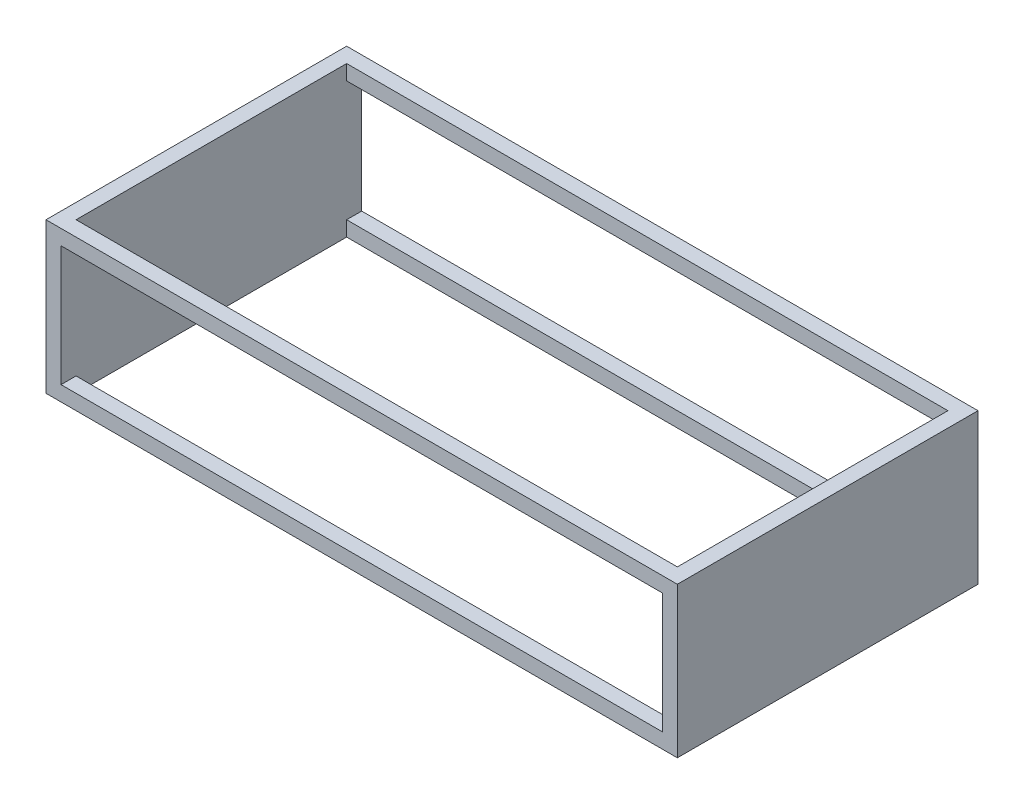
ISO-10303-21;
HEADER;
FILE_DESCRIPTION(('STEP AP214'),'2;1');
FILE_NAME('part.step','',(''),(''),'','','');
FILE_SCHEMA(('AUTOMOTIVE_DESIGN { 1 0 10303 214 1 1 1 1 }'));
ENDSEC;
DATA;
#1=APPLICATION_CONTEXT('core data for automotive mechanical design processes');
#2=APPLICATION_PROTOCOL_DEFINITION('international standard','automotive_design',2000,#1);
#3=PRODUCT_CONTEXT('',#1,'mechanical');
#4=PRODUCT('Part','Part','',(#3));
#5=PRODUCT_RELATED_PRODUCT_CATEGORY('part','',(#4));
#6=PRODUCT_DEFINITION_FORMATION('','',#4);
#7=PRODUCT_DEFINITION_CONTEXT('part definition',#1,'design');
#8=PRODUCT_DEFINITION('design','',#6,#7);
#9=PRODUCT_DEFINITION_SHAPE('','',#8);
#10=(LENGTH_UNIT() NAMED_UNIT(*) SI_UNIT(.MILLI.,.METRE.));
#11=(NAMED_UNIT(*) PLANE_ANGLE_UNIT() SI_UNIT($,.RADIAN.));
#12=(NAMED_UNIT(*) SI_UNIT($,.STERADIAN.) SOLID_ANGLE_UNIT());
#13=UNCERTAINTY_MEASURE_WITH_UNIT(LENGTH_MEASURE(1.E-05),#10,'distance_accuracy_value','');
#14=(GEOMETRIC_REPRESENTATION_CONTEXT(3) GLOBAL_UNCERTAINTY_ASSIGNED_CONTEXT((#13)) GLOBAL_UNIT_ASSIGNED_CONTEXT((#10,
#11,#12)) REPRESENTATION_CONTEXT('',''));
#15=CARTESIAN_POINT('',(0.,0.,0.));
#16=DIRECTION('',(0.,0.,1.));
#17=DIRECTION('',(1.,0.,0.));
#18=AXIS2_PLACEMENT_3D('',#15,#16,#17);
#19=CARTESIAN_POINT('',(-1000.,-250.001,450.));
#20=DIRECTION('',(0.,0.,1.));
#21=DIRECTION('',(1.,0.,0.));
#22=AXIS2_PLACEMENT_3D('',#19,#20,#21);
#23=PLANE('',#22);
#24=DIRECTION('',(0.,1.,0.));
#25=VECTOR('',#24,1.);
#26=CARTESIAN_POINT('',(-1000.,-250.001,450.));
#27=LINE('',#26,#25);
#28=CARTESIAN_POINT('',(-1000.,-250.,450.));
#29=VERTEX_POINT('',#28);
#30=CARTESIAN_POINT('',(-1000.,-200.,450.));
#31=VERTEX_POINT('',#30);
#32=EDGE_CURVE('E226',#29,#31,#27,.T.);
#33=ORIENTED_EDGE('',*,*,#32,.T.);
#34=DIRECTION('',(1.,0.,0.));
#35=VECTOR('',#34,1.);
#36=CARTESIAN_POINT('',(-1000.,-200.,450.));
#37=LINE('',#36,#35);
#38=CARTESIAN_POINT('',(1000.,-200.,450.));
#39=VERTEX_POINT('',#38);
#40=EDGE_CURVE('E192',#31,#39,#37,.T.);
#41=ORIENTED_EDGE('',*,*,#40,.T.);
#42=DIRECTION('',(0.,1.,0.));
#43=VECTOR('',#42,1.);
#44=CARTESIAN_POINT('',(1000.,-250.001,450.));
#45=LINE('',#44,#43);
#46=CARTESIAN_POINT('',(1000.,-250.,450.));
#47=VERTEX_POINT('',#46);
#48=EDGE_CURVE('E221',#47,#39,#45,.T.);
#49=ORIENTED_EDGE('',*,*,#48,.F.);
#50=DIRECTION('',(1.,0.,0.));
#51=VECTOR('',#50,1.);
#52=CARTESIAN_POINT('',(-1000.,-250.,450.));
#53=LINE('',#52,#51);
#54=EDGE_CURVE('E204',#29,#47,#53,.T.);
#55=ORIENTED_EDGE('',*,*,#54,.F.);
#56=EDGE_LOOP('',(#33,#41,#49,#55));
#57=FACE_BOUND('',#56,.T.);
#58=ADVANCED_FACE('F35',(#57),#23,.F.);
#59=CARTESIAN_POINT('',(-1000.,-250.001,-450.));
#60=DIRECTION('',(0.,0.,-1.));
#61=DIRECTION('',(-1.,0.,0.));
#62=AXIS2_PLACEMENT_3D('',#59,#60,#61);
#63=PLANE('',#62);
#64=DIRECTION('',(0.,1.,0.));
#65=VECTOR('',#64,1.);
#66=CARTESIAN_POINT('',(1000.,-250.001,-450.));
#67=LINE('',#66,#65);
#68=CARTESIAN_POINT('',(1000.,-250.,-450.));
#69=VERTEX_POINT('',#68);
#70=CARTESIAN_POINT('',(1000.,-200.,-450.));
#71=VERTEX_POINT('',#70);
#72=EDGE_CURVE('E234',#69,#71,#67,.T.);
#73=ORIENTED_EDGE('',*,*,#72,.T.);
#74=DIRECTION('',(-1.,0.,0.));
#75=VECTOR('',#74,1.);
#76=CARTESIAN_POINT('',(-1000.,-200.,-450.));
#77=LINE('',#76,#75);
#78=CARTESIAN_POINT('',(-1000.,-200.,-450.));
#79=VERTEX_POINT('',#78);
#80=EDGE_CURVE('E11',#71,#79,#77,.T.);
#81=ORIENTED_EDGE('',*,*,#80,.T.);
#82=DIRECTION('',(0.,1.,0.));
#83=VECTOR('',#82,1.);
#84=CARTESIAN_POINT('',(-1000.,-250.001,-450.));
#85=LINE('',#84,#83);
#86=CARTESIAN_POINT('',(-1000.,-250.,-450.));
#87=VERTEX_POINT('',#86);
#88=EDGE_CURVE('E230',#87,#79,#85,.T.);
#89=ORIENTED_EDGE('',*,*,#88,.F.);
#90=DIRECTION('',(-1.,0.,0.));
#91=VECTOR('',#90,1.);
#92=CARTESIAN_POINT('',(-1000.,-250.,-450.));
#93=LINE('',#92,#91);
#94=EDGE_CURVE('E224',#69,#87,#93,.T.);
#95=ORIENTED_EDGE('',*,*,#94,.F.);
#96=EDGE_LOOP('',(#73,#81,#89,#95));
#97=FACE_BOUND('',#96,.T.);
#98=ADVANCED_FACE('F301',(#97),#63,.F.);
#99=CARTESIAN_POINT('',(1050.,250.,500.));
#100=DIRECTION('',(-1.,0.,0.));
#101=DIRECTION('',(0.,0.,1.));
#102=AXIS2_PLACEMENT_3D('',#99,#100,#101);
#103=PLANE('',#102);
#104=DIRECTION('',(0.,0.,-1.));
#105=VECTOR('',#104,1.);
#106=CARTESIAN_POINT('',(1050.,-250.,500.));
#107=LINE('',#106,#105);
#108=CARTESIAN_POINT('',(1050.,-250.,500.));
#109=VERTEX_POINT('',#108);
#110=CARTESIAN_POINT('',(1050.,-250.,-500.));
#111=VERTEX_POINT('',#110);
#112=EDGE_CURVE('E239',#109,#111,#107,.T.);
#113=ORIENTED_EDGE('',*,*,#112,.T.);
#114=DIRECTION('',(0.,-1.,0.));
#115=VECTOR('',#114,1.);
#116=CARTESIAN_POINT('',(1050.,250.,-500.));
#117=LINE('',#116,#115);
#118=CARTESIAN_POINT('',(1050.,250.,-500.));
#119=VERTEX_POINT('',#118);
#120=EDGE_CURVE('E266',#119,#111,#117,.T.);
#121=ORIENTED_EDGE('',*,*,#120,.F.);
#122=DIRECTION('',(0.,0.,-1.));
#123=VECTOR('',#122,1.);
#124=CARTESIAN_POINT('',(1050.,250.,500.));
#125=LINE('',#124,#123);
#126=CARTESIAN_POINT('',(1050.,250.,500.));
#127=VERTEX_POINT('',#126);
#128=EDGE_CURVE('E240',#127,#119,#125,.T.);
#129=ORIENTED_EDGE('',*,*,#128,.F.);
#130=DIRECTION('',(0.,-1.,0.));
#131=VECTOR('',#130,1.);
#132=CARTESIAN_POINT('',(1050.,250.,500.));
#133=LINE('',#132,#131);
#134=EDGE_CURVE('E250',#127,#109,#133,.T.);
#135=ORIENTED_EDGE('',*,*,#134,.T.);
#136=EDGE_LOOP('',(#113,#121,#129,#135));
#137=FACE_BOUND('',#136,.T.);
#138=ADVANCED_FACE('F37',(#137),#103,.F.);
#139=CARTESIAN_POINT('',(-1050.,250.,-500.));
#140=DIRECTION('',(0.,0.,1.));
#141=DIRECTION('',(1.,0.,0.));
#142=AXIS2_PLACEMENT_3D('',#139,#140,#141);
#143=PLANE('',#142);
#144=DIRECTION('',(1.,0.,0.));
#145=VECTOR('',#144,1.);
#146=CARTESIAN_POINT('',(1000.,200.,-500.));
#147=LINE('',#146,#145);
#148=CARTESIAN_POINT('',(-1000.,200.,-500.));
#149=VERTEX_POINT('',#148);
#150=CARTESIAN_POINT('',(1000.,200.,-500.));
#151=VERTEX_POINT('',#150);
#152=EDGE_CURVE('E163',#149,#151,#147,.T.);
#153=ORIENTED_EDGE('',*,*,#152,.F.);
#154=DIRECTION('',(0.,1.,0.));
#155=VECTOR('',#154,1.);
#156=CARTESIAN_POINT('',(-1000.,-200.,-500.));
#157=LINE('',#156,#155);
#158=CARTESIAN_POINT('',(-1000.,-200.,-500.));
#159=VERTEX_POINT('',#158);
#160=EDGE_CURVE('E50',#159,#149,#157,.T.);
#161=ORIENTED_EDGE('',*,*,#160,.F.);
#162=DIRECTION('',(-1.,0.,0.));
#163=VECTOR('',#162,1.);
#164=CARTESIAN_POINT('',(1000.,-200.,-500.));
#165=LINE('',#164,#163);
#166=CARTESIAN_POINT('',(1000.,-200.,-500.));
#167=VERTEX_POINT('',#166);
#168=EDGE_CURVE('E171',#167,#159,#165,.T.);
#169=ORIENTED_EDGE('',*,*,#168,.F.);
#170=DIRECTION('',(0.,-1.,0.));
#171=VECTOR('',#170,1.);
#172=CARTESIAN_POINT('',(1000.,-200.,-500.));
#173=LINE('',#172,#171);
#174=EDGE_CURVE('E154',#151,#167,#173,.T.);
#175=ORIENTED_EDGE('',*,*,#174,.F.);
#176=EDGE_LOOP('',(#153,#161,#169,#175));
#177=FACE_BOUND('',#176,.T.);
#178=DIRECTION('',(-1.,0.,0.));
#179=VECTOR('',#178,1.);
#180=CARTESIAN_POINT('',(-1050.,-250.,-500.));
#181=LINE('',#180,#179);
#182=CARTESIAN_POINT('',(-1050.,-250.,-500.));
#183=VERTEX_POINT('',#182);
#184=EDGE_CURVE('E253',#111,#183,#181,.T.);
#185=ORIENTED_EDGE('',*,*,#184,.T.);
#186=DIRECTION('',(0.,-1.,0.));
#187=VECTOR('',#186,1.);
#188=CARTESIAN_POINT('',(-1050.,250.,-500.));
#189=LINE('',#188,#187);
#190=CARTESIAN_POINT('',(-1050.,250.,-500.));
#191=VERTEX_POINT('',#190);
#192=EDGE_CURVE('E263',#191,#183,#189,.T.);
#193=ORIENTED_EDGE('',*,*,#192,.F.);
#194=DIRECTION('',(-1.,0.,0.));
#195=VECTOR('',#194,1.);
#196=CARTESIAN_POINT('',(-1050.,250.,-500.));
#197=LINE('',#196,#195);
#198=EDGE_CURVE('E243',#119,#191,#197,.T.);
#199=ORIENTED_EDGE('',*,*,#198,.F.);
#200=ORIENTED_EDGE('',*,*,#120,.T.);
#201=EDGE_LOOP('',(#185,#193,#199,#200));
#202=FACE_BOUND('',#201,.T.);
#203=ADVANCED_FACE('F168',(#177,#202),#143,.F.);
#204=CARTESIAN_POINT('',(-1050.,250.,500.));
#205=DIRECTION('',(1.,0.,0.));
#206=DIRECTION('',(0.,0.,-1.));
#207=AXIS2_PLACEMENT_3D('',#204,#205,#206);
#208=PLANE('',#207);
#209=DIRECTION('',(0.,0.,1.));
#210=VECTOR('',#209,1.);
#211=CARTESIAN_POINT('',(-1050.,-250.,500.));
#212=LINE('',#211,#210);
#213=CARTESIAN_POINT('',(-1050.,-250.,500.));
#214=VERTEX_POINT('',#213);
#215=EDGE_CURVE('E255',#183,#214,#212,.T.);
#216=ORIENTED_EDGE('',*,*,#215,.T.);
#217=DIRECTION('',(0.,-1.,0.));
#218=VECTOR('',#217,1.);
#219=CARTESIAN_POINT('',(-1050.,250.,500.));
#220=LINE('',#219,#218);
#221=CARTESIAN_POINT('',(-1050.,250.,500.));
#222=VERTEX_POINT('',#221);
#223=EDGE_CURVE('E260',#222,#214,#220,.T.);
#224=ORIENTED_EDGE('',*,*,#223,.F.);
#225=DIRECTION('',(0.,0.,1.));
#226=VECTOR('',#225,1.);
#227=CARTESIAN_POINT('',(-1050.,250.,500.));
#228=LINE('',#227,#226);
#229=EDGE_CURVE('E246',#191,#222,#228,.T.);
#230=ORIENTED_EDGE('',*,*,#229,.F.);
#231=ORIENTED_EDGE('',*,*,#192,.T.);
#232=EDGE_LOOP('',(#216,#224,#230,#231));
#233=FACE_BOUND('',#232,.T.);
#234=ADVANCED_FACE('F334',(#233),#208,.F.);
#235=CARTESIAN_POINT('',(-1050.,250.,500.));
#236=DIRECTION('',(0.,0.,-1.));
#237=DIRECTION('',(-1.,0.,0.));
#238=AXIS2_PLACEMENT_3D('',#235,#236,#237);
#239=PLANE('',#238);
#240=DIRECTION('',(-1.,0.,0.));
#241=VECTOR('',#240,1.);
#242=CARTESIAN_POINT('',(-1050.,-200.,500.));
#243=LINE('',#242,#241);
#244=CARTESIAN_POINT('',(1000.,-200.,500.));
#245=VERTEX_POINT('',#244);
#246=CARTESIAN_POINT('',(-1000.,-200.,500.));
#247=VERTEX_POINT('',#246);
#248=EDGE_CURVE('E195',#245,#247,#243,.T.);
#249=ORIENTED_EDGE('',*,*,#248,.T.);
#250=DIRECTION('',(0.,1.,0.));
#251=VECTOR('',#250,1.);
#252=CARTESIAN_POINT('',(-1000.,250.,500.));
#253=LINE('',#252,#251);
#254=CARTESIAN_POINT('',(-1000.,200.,500.));
#255=VERTEX_POINT('',#254);
#256=EDGE_CURVE('E198',#247,#255,#253,.T.);
#257=ORIENTED_EDGE('',*,*,#256,.T.);
#258=DIRECTION('',(1.,0.,0.));
#259=VECTOR('',#258,1.);
#260=CARTESIAN_POINT('',(-1050.,200.,500.));
#261=LINE('',#260,#259);
#262=CARTESIAN_POINT('',(1000.,200.,500.));
#263=VERTEX_POINT('',#262);
#264=EDGE_CURVE('E186',#255,#263,#261,.T.);
#265=ORIENTED_EDGE('',*,*,#264,.T.);
#266=DIRECTION('',(0.,-1.,0.));
#267=VECTOR('',#266,1.);
#268=CARTESIAN_POINT('',(1000.,250.,500.));
#269=LINE('',#268,#267);
#270=EDGE_CURVE('E189',#263,#245,#269,.T.);
#271=ORIENTED_EDGE('',*,*,#270,.T.);
#272=EDGE_LOOP('',(#249,#257,#265,#271));
#273=FACE_BOUND('',#272,.T.);
#274=DIRECTION('',(1.,0.,0.));
#275=VECTOR('',#274,1.);
#276=CARTESIAN_POINT('',(-1050.,-250.,500.));
#277=LINE('',#276,#275);
#278=EDGE_CURVE('E244',#214,#109,#277,.T.);
#279=ORIENTED_EDGE('',*,*,#278,.T.);
#280=ORIENTED_EDGE('',*,*,#134,.F.);
#281=DIRECTION('',(1.,0.,0.));
#282=VECTOR('',#281,1.);
#283=CARTESIAN_POINT('',(-1050.,250.,500.));
#284=LINE('',#283,#282);
#285=EDGE_CURVE('E248',#222,#127,#284,.T.);
#286=ORIENTED_EDGE('',*,*,#285,.F.);
#287=ORIENTED_EDGE('',*,*,#223,.T.);
#288=EDGE_LOOP('',(#279,#280,#286,#287));
#289=FACE_BOUND('',#288,.T.);
#290=ADVANCED_FACE('F287',(#273,#289),#239,.F.);
#291=CARTESIAN_POINT('',(0.,250.,0.));
#292=DIRECTION('',(0.,-1.,0.));
#293=DIRECTION('',(0.,0.,-1.));
#294=AXIS2_PLACEMENT_3D('',#291,#292,#293);
#295=PLANE('',#294);
#296=DIRECTION('',(-1.,0.,0.));
#297=VECTOR('',#296,1.);
#298=CARTESIAN_POINT('',(-1000.,250.,-450.));
#299=LINE('',#298,#297);
#300=CARTESIAN_POINT('',(1000.,250.,-450.));
#301=VERTEX_POINT('',#300);
#302=CARTESIAN_POINT('',(-1000.,250.,-450.));
#303=VERTEX_POINT('',#302);
#304=EDGE_CURVE('E212',#301,#303,#299,.T.);
#305=ORIENTED_EDGE('',*,*,#304,.F.);
#306=DIRECTION('',(0.,0.,-1.));
#307=VECTOR('',#306,1.);
#308=CARTESIAN_POINT('',(1000.,250.,450.));
#309=LINE('',#308,#307);
#310=CARTESIAN_POINT('',(1000.,250.,450.));
#311=VERTEX_POINT('',#310);
#312=EDGE_CURVE('E210',#311,#301,#309,.T.);
#313=ORIENTED_EDGE('',*,*,#312,.F.);
#314=DIRECTION('',(1.,0.,0.));
#315=VECTOR('',#314,1.);
#316=CARTESIAN_POINT('',(-1000.,250.,450.));
#317=LINE('',#316,#315);
#318=CARTESIAN_POINT('',(-1000.,250.,450.));
#319=VERTEX_POINT('',#318);
#320=EDGE_CURVE('E218',#319,#311,#317,.T.);
#321=ORIENTED_EDGE('',*,*,#320,.F.);
#322=DIRECTION('',(0.,0.,1.));
#323=VECTOR('',#322,1.);
#324=CARTESIAN_POINT('',(-1000.,250.,450.));
#325=LINE('',#324,#323);
#326=EDGE_CURVE('E215',#303,#319,#325,.T.);
#327=ORIENTED_EDGE('',*,*,#326,.F.);
#328=EDGE_LOOP('',(#305,#313,#321,#327));
#329=FACE_BOUND('',#328,.T.);
#330=ORIENTED_EDGE('',*,*,#128,.T.);
#331=ORIENTED_EDGE('',*,*,#198,.T.);
#332=ORIENTED_EDGE('',*,*,#229,.T.);
#333=ORIENTED_EDGE('',*,*,#285,.T.);
#334=EDGE_LOOP('',(#330,#331,#332,#333));
#335=FACE_BOUND('',#334,.T.);
#336=ADVANCED_FACE('F278',(#329,#335),#295,.F.);
#337=CARTESIAN_POINT('',(0.,-250.,0.));
#338=DIRECTION('',(0.,-1.,0.));
#339=DIRECTION('',(0.,0.,-1.));
#340=AXIS2_PLACEMENT_3D('',#337,#338,#339);
#341=PLANE('',#340);
#342=DIRECTION('',(0.,0.,-1.));
#343=VECTOR('',#342,1.);
#344=CARTESIAN_POINT('',(1000.,-250.,450.));
#345=LINE('',#344,#343);
#346=EDGE_CURVE('E207',#47,#69,#345,.T.);
#347=ORIENTED_EDGE('',*,*,#346,.T.);
#348=ORIENTED_EDGE('',*,*,#94,.T.);
#349=DIRECTION('',(0.,0.,1.));
#350=VECTOR('',#349,1.);
#351=CARTESIAN_POINT('',(-1000.,-250.,450.));
#352=LINE('',#351,#350);
#353=EDGE_CURVE('E201',#87,#29,#352,.T.);
#354=ORIENTED_EDGE('',*,*,#353,.T.);
#355=ORIENTED_EDGE('',*,*,#54,.T.);
#356=EDGE_LOOP('',(#347,#348,#354,#355));
#357=FACE_BOUND('',#356,.T.);
#358=ORIENTED_EDGE('',*,*,#112,.F.);
#359=ORIENTED_EDGE('',*,*,#278,.F.);
#360=ORIENTED_EDGE('',*,*,#215,.F.);
#361=ORIENTED_EDGE('',*,*,#184,.F.);
#362=EDGE_LOOP('',(#358,#359,#360,#361));
#363=FACE_BOUND('',#362,.T.);
#364=ADVANCED_FACE('F297',(#357,#363),#341,.T.);
#365=CARTESIAN_POINT('',(1000.,-250.001,450.));
#366=DIRECTION('',(1.,0.,0.));
#367=DIRECTION('',(0.,0.,-1.));
#368=AXIS2_PLACEMENT_3D('',#365,#366,#367);
#369=PLANE('',#368);
#370=CARTESIAN_POINT('',(1000.,200.,-450.));
#371=VERTEX_POINT('',#370);
#372=EDGE_CURVE('E157',#371,#301,#67,.T.);
#373=ORIENTED_EDGE('',*,*,#372,.F.);
#374=DIRECTION('',(0.,0.,-1.));
#375=VECTOR('',#374,1.);
#376=CARTESIAN_POINT('',(1000.,200.,705.999999999999));
#377=LINE('',#376,#375);
#378=EDGE_CURVE('E149',#371,#151,#377,.T.);
#379=ORIENTED_EDGE('',*,*,#378,.T.);
#380=ORIENTED_EDGE('',*,*,#174,.T.);
#381=DIRECTION('',(0.,0.,-1.));
#382=VECTOR('',#381,1.);
#383=CARTESIAN_POINT('',(1000.,-200.,705.999999999999));
#384=LINE('',#383,#382);
#385=EDGE_CURVE('E180',#71,#167,#384,.T.);
#386=ORIENTED_EDGE('',*,*,#385,.F.);
#387=ORIENTED_EDGE('',*,*,#72,.F.);
#388=ORIENTED_EDGE('',*,*,#346,.F.);
#389=ORIENTED_EDGE('',*,*,#48,.T.);
#390=EDGE_CURVE('E179',#245,#39,#384,.T.);
#391=ORIENTED_EDGE('',*,*,#390,.F.);
#392=ORIENTED_EDGE('',*,*,#270,.F.);
#393=CARTESIAN_POINT('',(1000.,200.,450.));
#394=VERTEX_POINT('',#393);
#395=EDGE_CURVE('E58',#263,#394,#377,.T.);
#396=ORIENTED_EDGE('',*,*,#395,.T.);
#397=EDGE_CURVE('E225',#394,#311,#45,.T.);
#398=ORIENTED_EDGE('',*,*,#397,.T.);
#399=ORIENTED_EDGE('',*,*,#312,.T.);
#400=EDGE_LOOP('',(#373,#379,#380,#386,#387,#388,#389,#391,#392,#396,#398,#399));
#401=FACE_BOUND('',#400,.T.);
#402=ADVANCED_FACE('F151',(#401),#369,.F.);
#403=ORIENTED_EDGE('',*,*,#397,.F.);
#404=DIRECTION('',(-1.,0.,0.));
#405=VECTOR('',#404,1.);
#406=CARTESIAN_POINT('',(-1000.,200.,450.));
#407=LINE('',#406,#405);
#408=CARTESIAN_POINT('',(-1000.,200.,450.));
#409=VERTEX_POINT('',#408);
#410=EDGE_CURVE('E183',#394,#409,#407,.T.);
#411=ORIENTED_EDGE('',*,*,#410,.T.);
#412=EDGE_CURVE('E229',#409,#319,#27,.T.);
#413=ORIENTED_EDGE('',*,*,#412,.T.);
#414=ORIENTED_EDGE('',*,*,#320,.T.);
#415=EDGE_LOOP('',(#403,#411,#413,#414));
#416=FACE_BOUND('',#415,.T.);
#417=ADVANCED_FACE('F282',(#416),#23,.F.);
#418=CARTESIAN_POINT('',(-1000.,-250.001,450.));
#419=DIRECTION('',(-1.,0.,0.));
#420=DIRECTION('',(0.,0.,1.));
#421=AXIS2_PLACEMENT_3D('',#418,#419,#420);
#422=PLANE('',#421);
#423=ORIENTED_EDGE('',*,*,#412,.F.);
#424=DIRECTION('',(0.,0.,-1.));
#425=VECTOR('',#424,1.);
#426=CARTESIAN_POINT('',(-1000.,200.,705.999999999999));
#427=LINE('',#426,#425);
#428=EDGE_CURVE('E160',#255,#409,#427,.T.);
#429=ORIENTED_EDGE('',*,*,#428,.F.);
#430=ORIENTED_EDGE('',*,*,#256,.F.);
#431=DIRECTION('',(0.,0.,-1.));
#432=VECTOR('',#431,1.);
#433=CARTESIAN_POINT('',(-1000.,-200.,705.999999999999));
#434=LINE('',#433,#432);
#435=EDGE_CURVE('E178',#247,#31,#434,.T.);
#436=ORIENTED_EDGE('',*,*,#435,.T.);
#437=ORIENTED_EDGE('',*,*,#32,.F.);
#438=ORIENTED_EDGE('',*,*,#353,.F.);
#439=ORIENTED_EDGE('',*,*,#88,.T.);
#440=EDGE_CURVE('E176',#79,#159,#434,.T.);
#441=ORIENTED_EDGE('',*,*,#440,.T.);
#442=ORIENTED_EDGE('',*,*,#160,.T.);
#443=CARTESIAN_POINT('',(-1000.,200.,-450.));
#444=VERTEX_POINT('',#443);
#445=EDGE_CURVE('E165',#444,#149,#427,.T.);
#446=ORIENTED_EDGE('',*,*,#445,.F.);
#447=EDGE_CURVE('E233',#444,#303,#85,.T.);
#448=ORIENTED_EDGE('',*,*,#447,.T.);
#449=ORIENTED_EDGE('',*,*,#326,.T.);
#450=EDGE_LOOP('',(#423,#429,#430,#436,#437,#438,#439,#441,#442,#446,#448,#449));
#451=FACE_BOUND('',#450,.T.);
#452=ADVANCED_FACE('F272',(#451),#422,.F.);
#453=ORIENTED_EDGE('',*,*,#447,.F.);
#454=DIRECTION('',(1.,0.,0.));
#455=VECTOR('',#454,1.);
#456=CARTESIAN_POINT('',(-1000.,200.,-450.));
#457=LINE('',#456,#455);
#458=EDGE_CURVE('E43',#444,#371,#457,.T.);
#459=ORIENTED_EDGE('',*,*,#458,.T.);
#460=ORIENTED_EDGE('',*,*,#372,.T.);
#461=ORIENTED_EDGE('',*,*,#304,.T.);
#462=EDGE_LOOP('',(#453,#459,#460,#461));
#463=FACE_BOUND('',#462,.T.);
#464=ADVANCED_FACE('F270',(#463),#63,.F.);
#465=CARTESIAN_POINT('',(1000.,200.,705.999999999999));
#466=DIRECTION('',(0.,1.,0.));
#467=DIRECTION('',(0.,0.,1.));
#468=AXIS2_PLACEMENT_3D('',#465,#466,#467);
#469=PLANE('',#468);
#470=ORIENTED_EDGE('',*,*,#445,.T.);
#471=ORIENTED_EDGE('',*,*,#152,.T.);
#472=ORIENTED_EDGE('',*,*,#378,.F.);
#473=ORIENTED_EDGE('',*,*,#458,.F.);
#474=EDGE_LOOP('',(#470,#471,#472,#473));
#475=FACE_BOUND('',#474,.T.);
#476=ADVANCED_FACE('F164',(#475),#469,.F.);
#477=CARTESIAN_POINT('',(1000.,-200.,705.999999999999));
#478=DIRECTION('',(0.,-1.,0.));
#479=DIRECTION('',(0.,0.,-1.));
#480=AXIS2_PLACEMENT_3D('',#477,#478,#479);
#481=PLANE('',#480);
#482=ORIENTED_EDGE('',*,*,#385,.T.);
#483=ORIENTED_EDGE('',*,*,#168,.T.);
#484=ORIENTED_EDGE('',*,*,#440,.F.);
#485=ORIENTED_EDGE('',*,*,#80,.F.);
#486=EDGE_LOOP('',(#482,#483,#484,#485));
#487=FACE_BOUND('',#486,.T.);
#488=ADVANCED_FACE('F303',(#487),#481,.F.);
#489=ORIENTED_EDGE('',*,*,#390,.T.);
#490=ORIENTED_EDGE('',*,*,#40,.F.);
#491=ORIENTED_EDGE('',*,*,#435,.F.);
#492=ORIENTED_EDGE('',*,*,#248,.F.);
#493=EDGE_LOOP('',(#489,#490,#491,#492));
#494=FACE_BOUND('',#493,.T.);
#495=ADVANCED_FACE('F291',(#494),#481,.F.);
#496=ORIENTED_EDGE('',*,*,#428,.T.);
#497=ORIENTED_EDGE('',*,*,#410,.F.);
#498=ORIENTED_EDGE('',*,*,#395,.F.);
#499=ORIENTED_EDGE('',*,*,#264,.F.);
#500=EDGE_LOOP('',(#496,#497,#498,#499));
#501=FACE_BOUND('',#500,.T.);
#502=ADVANCED_FACE('F310',(#501),#469,.F.);
#503=CLOSED_SHELL('',(#58,#98,#138,#203,#234,#290,#336,#364,#402,#417,#452,#464,#476,#488,#495,#502));
#504=MANIFOLD_SOLID_BREP('B2',#503);
#505=ADVANCED_BREP_SHAPE_REPRESENTATION('',(#18,#504),#14);
#506=SHAPE_DEFINITION_REPRESENTATION(#9,#505);
ENDSEC;
END-ISO-10303-21;
